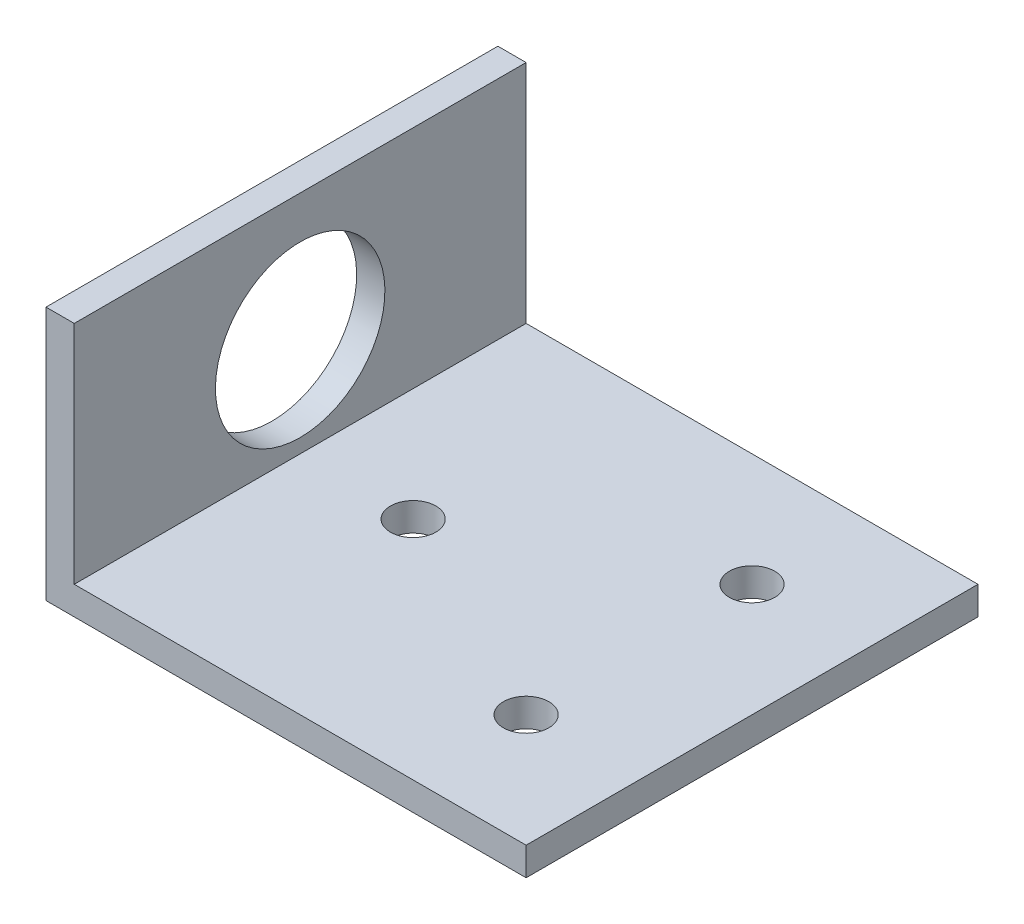
ISO-10303-21;
HEADER;
FILE_DESCRIPTION(('STEP AP214'),'2;1');
FILE_NAME('part.step','',(''),(''),'','','');
FILE_SCHEMA(('AUTOMOTIVE_DESIGN { 1 0 10303 214 1 1 1 1 }'));
ENDSEC;
DATA;
#1=APPLICATION_CONTEXT('core data for automotive mechanical design processes');
#2=APPLICATION_PROTOCOL_DEFINITION('international standard','automotive_design',2000,#1);
#3=PRODUCT_CONTEXT('',#1,'mechanical');
#4=PRODUCT('Part','Part','',(#3));
#5=PRODUCT_RELATED_PRODUCT_CATEGORY('part','',(#4));
#6=PRODUCT_DEFINITION_FORMATION('','',#4);
#7=PRODUCT_DEFINITION_CONTEXT('part definition',#1,'design');
#8=PRODUCT_DEFINITION('design','',#6,#7);
#9=PRODUCT_DEFINITION_SHAPE('','',#8);
#10=(LENGTH_UNIT() NAMED_UNIT(*) SI_UNIT(.MILLI.,.METRE.));
#11=(NAMED_UNIT(*) PLANE_ANGLE_UNIT() SI_UNIT($,.RADIAN.));
#12=(NAMED_UNIT(*) SI_UNIT($,.STERADIAN.) SOLID_ANGLE_UNIT());
#13=UNCERTAINTY_MEASURE_WITH_UNIT(LENGTH_MEASURE(1.E-05),#10,'distance_accuracy_value','');
#14=(GEOMETRIC_REPRESENTATION_CONTEXT(3) GLOBAL_UNCERTAINTY_ASSIGNED_CONTEXT((#13)) GLOBAL_UNIT_ASSIGNED_CONTEXT((#10,
#11,#12)) REPRESENTATION_CONTEXT('',''));
#15=CARTESIAN_POINT('',(0.,0.,0.));
#16=DIRECTION('',(0.,0.,1.));
#17=DIRECTION('',(1.,0.,0.));
#18=AXIS2_PLACEMENT_3D('',#15,#16,#17);
#19=CARTESIAN_POINT('',(3.175,50.8,50.8));
#20=DIRECTION('',(-1.,0.,0.));
#21=DIRECTION('',(0.,-1.,0.));
#22=AXIS2_PLACEMENT_3D('',#19,#20,#21);
#23=PLANE('',#22);
#24=CARTESIAN_POINT('',(3.175,14.2875,25.4));
#25=DIRECTION('',(-1.,0.,0.));
#26=DIRECTION('',(0.,-1.,0.));
#27=AXIS2_PLACEMENT_3D('',#24,#25,#26);
#28=CIRCLE('',#27,9.525);
#29=CARTESIAN_POINT('',(3.17500000000001,4.7625,25.4));
#30=VERTEX_POINT('',#29);
#31=EDGE_CURVE('E114',#30,#30,#28,.T.);
#32=ORIENTED_EDGE('',*,*,#31,.T.);
#33=EDGE_LOOP('',(#32));
#34=FACE_BOUND('',#33,.T.);
#35=DIRECTION('',(0.,1.,0.));
#36=VECTOR('',#35,1.);
#37=CARTESIAN_POINT('',(3.175,50.8,0.));
#38=LINE('',#37,#36);
#39=CARTESIAN_POINT('',(3.17500000000001,3.175,0.));
#40=VERTEX_POINT('',#39);
#41=CARTESIAN_POINT('',(3.175,28.575,0.));
#42=VERTEX_POINT('',#41);
#43=EDGE_CURVE('E110',#40,#42,#38,.T.);
#44=ORIENTED_EDGE('',*,*,#43,.T.);
#45=DIRECTION('',(0.,0.,1.));
#46=VECTOR('',#45,1.);
#47=CARTESIAN_POINT('',(3.175,28.575,50.8));
#48=LINE('',#47,#46);
#49=CARTESIAN_POINT('',(3.175,28.575,50.8));
#50=VERTEX_POINT('',#49);
#51=EDGE_CURVE('E48',#42,#50,#48,.T.);
#52=ORIENTED_EDGE('',*,*,#51,.T.);
#53=DIRECTION('',(0.,1.,0.));
#54=VECTOR('',#53,1.);
#55=CARTESIAN_POINT('',(3.175,50.8,50.8));
#56=LINE('',#55,#54);
#57=CARTESIAN_POINT('',(3.17500000000001,3.175,50.8));
#58=VERTEX_POINT('',#57);
#59=EDGE_CURVE('E120',#58,#50,#56,.T.);
#60=ORIENTED_EDGE('',*,*,#59,.F.);
#61=DIRECTION('',(0.,0.,-1.));
#62=VECTOR('',#61,1.);
#63=CARTESIAN_POINT('',(3.17500000000001,3.175,50.8));
#64=LINE('',#63,#62);
#65=EDGE_CURVE('E121',#58,#40,#64,.T.);
#66=ORIENTED_EDGE('',*,*,#65,.T.);
#67=EDGE_LOOP('',(#44,#52,#60,#66));
#68=FACE_BOUND('',#67,.T.);
#69=ADVANCED_FACE('F32',(#34,#68),#23,.F.);
#70=CARTESIAN_POINT('',(0.,50.8,50.8));
#71=DIRECTION('',(1.,0.,0.));
#72=DIRECTION('',(0.,1.,0.));
#73=AXIS2_PLACEMENT_3D('',#70,#71,#72);
#74=PLANE('',#73);
#75=CARTESIAN_POINT('',(0.,14.2875,25.4));
#76=DIRECTION('',(-1.,0.,0.));
#77=DIRECTION('',(0.,-1.,0.));
#78=AXIS2_PLACEMENT_3D('',#75,#76,#77);
#79=CIRCLE('',#78,9.525);
#80=CARTESIAN_POINT('',(0.,4.7625,25.4));
#81=VERTEX_POINT('',#80);
#82=EDGE_CURVE('E148',#81,#81,#79,.T.);
#83=ORIENTED_EDGE('',*,*,#82,.F.);
#84=EDGE_LOOP('',(#83));
#85=FACE_BOUND('',#84,.T.);
#86=DIRECTION('',(0.,-1.,0.));
#87=VECTOR('',#86,1.);
#88=CARTESIAN_POINT('',(0.,50.8,50.8));
#89=LINE('',#88,#87);
#90=CARTESIAN_POINT('',(0.,28.575,50.8));
#91=VERTEX_POINT('',#90);
#92=CARTESIAN_POINT('',(0.,0.,50.8));
#93=VERTEX_POINT('',#92);
#94=EDGE_CURVE('E84',#91,#93,#89,.T.);
#95=ORIENTED_EDGE('',*,*,#94,.F.);
#96=DIRECTION('',(0.,0.,1.));
#97=VECTOR('',#96,1.);
#98=CARTESIAN_POINT('',(0.,28.575,50.8));
#99=LINE('',#98,#97);
#100=CARTESIAN_POINT('',(0.,28.575,0.));
#101=VERTEX_POINT('',#100);
#102=EDGE_CURVE('E94',#101,#91,#99,.T.);
#103=ORIENTED_EDGE('',*,*,#102,.F.);
#104=DIRECTION('',(0.,-1.,0.));
#105=VECTOR('',#104,1.);
#106=CARTESIAN_POINT('',(0.,50.8,0.));
#107=LINE('',#106,#105);
#108=CARTESIAN_POINT('',(0.,0.,0.));
#109=VERTEX_POINT('',#108);
#110=EDGE_CURVE('E101',#101,#109,#107,.T.);
#111=ORIENTED_EDGE('',*,*,#110,.T.);
#112=DIRECTION('',(0.,0.,-1.));
#113=VECTOR('',#112,1.);
#114=CARTESIAN_POINT('',(0.,0.,50.8));
#115=LINE('',#114,#113);
#116=EDGE_CURVE('E40',#93,#109,#115,.T.);
#117=ORIENTED_EDGE('',*,*,#116,.F.);
#118=EDGE_LOOP('',(#95,#103,#111,#117));
#119=FACE_BOUND('',#118,.T.);
#120=ADVANCED_FACE('F100',(#85,#119),#74,.F.);
#121=CARTESIAN_POINT('',(3.17500000000001,0.,50.8));
#122=DIRECTION('',(0.,1.,0.));
#123=DIRECTION('',(-1.,0.,0.));
#124=AXIS2_PLACEMENT_3D('',#121,#122,#123);
#125=PLANE('',#124);
#126=CARTESIAN_POINT('',(41.275,0.,12.7));
#127=DIRECTION('',(0.,-1.,0.));
#128=DIRECTION('',(1.,0.,0.));
#129=AXIS2_PLACEMENT_3D('',#126,#127,#128);
#130=CIRCLE('',#129,2.5527);
#131=CARTESIAN_POINT('',(43.8277,0.,12.7));
#132=VERTEX_POINT('',#131);
#133=EDGE_CURVE('E143',#132,#132,#130,.T.);
#134=ORIENTED_EDGE('',*,*,#133,.F.);
#135=EDGE_LOOP('',(#134));
#136=FACE_BOUND('',#135,.T.);
#137=CARTESIAN_POINT('',(41.275,0.,38.1));
#138=DIRECTION('',(0.,-1.,0.));
#139=DIRECTION('',(1.,0.,0.));
#140=AXIS2_PLACEMENT_3D('',#137,#138,#139);
#141=CIRCLE('',#140,2.5527);
#142=CARTESIAN_POINT('',(43.8277,0.,38.1));
#143=VERTEX_POINT('',#142);
#144=EDGE_CURVE('E133',#143,#143,#141,.T.);
#145=ORIENTED_EDGE('',*,*,#144,.F.);
#146=EDGE_LOOP('',(#145));
#147=FACE_BOUND('',#146,.T.);
#148=CARTESIAN_POINT('',(15.875,0.,25.4));
#149=DIRECTION('',(0.,-1.,0.));
#150=DIRECTION('',(1.,0.,0.));
#151=AXIS2_PLACEMENT_3D('',#148,#149,#150);
#152=CIRCLE('',#151,2.5527);
#153=CARTESIAN_POINT('',(18.4277,0.,25.4));
#154=VERTEX_POINT('',#153);
#155=EDGE_CURVE('E130',#154,#154,#152,.T.);
#156=ORIENTED_EDGE('',*,*,#155,.F.);
#157=EDGE_LOOP('',(#156));
#158=FACE_BOUND('',#157,.T.);
#159=DIRECTION('',(1.,0.,0.));
#160=VECTOR('',#159,1.);
#161=CARTESIAN_POINT('',(3.17500000000001,0.,0.));
#162=LINE('',#161,#160);
#163=CARTESIAN_POINT('',(53.975,0.,0.));
#164=VERTEX_POINT('',#163);
#165=EDGE_CURVE('E108',#109,#164,#162,.T.);
#166=ORIENTED_EDGE('',*,*,#165,.T.);
#167=DIRECTION('',(0.,0.,-1.));
#168=VECTOR('',#167,1.);
#169=CARTESIAN_POINT('',(53.975,0.,50.8));
#170=LINE('',#169,#168);
#171=CARTESIAN_POINT('',(53.975,0.,50.8));
#172=VERTEX_POINT('',#171);
#173=EDGE_CURVE('E125',#172,#164,#170,.T.);
#174=ORIENTED_EDGE('',*,*,#173,.F.);
#175=DIRECTION('',(1.,0.,0.));
#176=VECTOR('',#175,1.);
#177=CARTESIAN_POINT('',(3.17500000000001,0.,50.8));
#178=LINE('',#177,#176);
#179=EDGE_CURVE('E155',#93,#172,#178,.T.);
#180=ORIENTED_EDGE('',*,*,#179,.F.);
#181=ORIENTED_EDGE('',*,*,#116,.T.);
#182=EDGE_LOOP('',(#166,#174,#180,#181));
#183=FACE_BOUND('',#182,.T.);
#184=ADVANCED_FACE('F173',(#136,#147,#158,#183),#125,.F.);
#185=CARTESIAN_POINT('',(53.975,0.,50.8));
#186=DIRECTION('',(-1.,0.,0.));
#187=DIRECTION('',(0.,0.,1.));
#188=AXIS2_PLACEMENT_3D('',#185,#186,#187);
#189=PLANE('',#188);
#190=DIRECTION('',(0.,1.,0.));
#191=VECTOR('',#190,1.);
#192=CARTESIAN_POINT('',(53.975,0.,0.));
#193=LINE('',#192,#191);
#194=CARTESIAN_POINT('',(53.975,3.175,0.));
#195=VERTEX_POINT('',#194);
#196=EDGE_CURVE('E112',#164,#195,#193,.T.);
#197=ORIENTED_EDGE('',*,*,#196,.T.);
#198=DIRECTION('',(0.,0.,-1.));
#199=VECTOR('',#198,1.);
#200=CARTESIAN_POINT('',(53.975,3.175,50.8));
#201=LINE('',#200,#199);
#202=CARTESIAN_POINT('',(53.975,3.175,50.8));
#203=VERTEX_POINT('',#202);
#204=EDGE_CURVE('E123',#203,#195,#201,.T.);
#205=ORIENTED_EDGE('',*,*,#204,.F.);
#206=DIRECTION('',(0.,1.,0.));
#207=VECTOR('',#206,1.);
#208=CARTESIAN_POINT('',(53.975,0.,50.8));
#209=LINE('',#208,#207);
#210=EDGE_CURVE('E157',#172,#203,#209,.T.);
#211=ORIENTED_EDGE('',*,*,#210,.F.);
#212=ORIENTED_EDGE('',*,*,#173,.T.);
#213=EDGE_LOOP('',(#197,#205,#211,#212));
#214=FACE_BOUND('',#213,.T.);
#215=ADVANCED_FACE('F164',(#214),#189,.F.);
#216=CARTESIAN_POINT('',(3.17500000000001,3.175,50.8));
#217=DIRECTION('',(0.,-1.,0.));
#218=DIRECTION('',(0.,0.,-1.));
#219=AXIS2_PLACEMENT_3D('',#216,#217,#218);
#220=PLANE('',#219);
#221=CARTESIAN_POINT('',(41.275,3.175,12.7));
#222=DIRECTION('',(0.,-1.,0.));
#223=DIRECTION('',(0.,0.,-1.));
#224=AXIS2_PLACEMENT_3D('',#221,#222,#223);
#225=CIRCLE('',#224,2.5527);
#226=CARTESIAN_POINT('',(41.275,3.175,10.1473));
#227=VERTEX_POINT('',#226);
#228=EDGE_CURVE('E35',#227,#227,#225,.T.);
#229=ORIENTED_EDGE('',*,*,#228,.T.);
#230=EDGE_LOOP('',(#229));
#231=FACE_BOUND('',#230,.T.);
#232=CARTESIAN_POINT('',(41.275,3.175,38.1));
#233=DIRECTION('',(0.,-1.,0.));
#234=DIRECTION('',(0.,0.,-1.));
#235=AXIS2_PLACEMENT_3D('',#232,#233,#234);
#236=CIRCLE('',#235,2.5527);
#237=CARTESIAN_POINT('',(41.275,3.175,35.5473));
#238=VERTEX_POINT('',#237);
#239=EDGE_CURVE('E131',#238,#238,#236,.T.);
#240=ORIENTED_EDGE('',*,*,#239,.T.);
#241=EDGE_LOOP('',(#240));
#242=FACE_BOUND('',#241,.T.);
#243=CARTESIAN_POINT('',(15.875,3.175,25.4));
#244=DIRECTION('',(0.,-1.,0.));
#245=DIRECTION('',(0.,0.,-1.));
#246=AXIS2_PLACEMENT_3D('',#243,#244,#245);
#247=CIRCLE('',#246,2.5527);
#248=CARTESIAN_POINT('',(15.875,3.175,22.8473));
#249=VERTEX_POINT('',#248);
#250=EDGE_CURVE('E104',#249,#249,#247,.T.);
#251=ORIENTED_EDGE('',*,*,#250,.T.);
#252=EDGE_LOOP('',(#251));
#253=FACE_BOUND('',#252,.T.);
#254=DIRECTION('',(-1.,0.,0.));
#255=VECTOR('',#254,1.);
#256=CARTESIAN_POINT('',(3.17500000000001,3.175,0.));
#257=LINE('',#256,#255);
#258=EDGE_CURVE('E77',#195,#40,#257,.T.);
#259=ORIENTED_EDGE('',*,*,#258,.T.);
#260=ORIENTED_EDGE('',*,*,#65,.F.);
#261=DIRECTION('',(-1.,0.,0.));
#262=VECTOR('',#261,1.);
#263=CARTESIAN_POINT('',(3.17500000000001,3.175,50.8));
#264=LINE('',#263,#262);
#265=EDGE_CURVE('E56',#203,#58,#264,.T.);
#266=ORIENTED_EDGE('',*,*,#265,.F.);
#267=ORIENTED_EDGE('',*,*,#204,.T.);
#268=EDGE_LOOP('',(#259,#260,#266,#267));
#269=FACE_BOUND('',#268,.T.);
#270=ADVANCED_FACE('F165',(#231,#242,#253,#269),#220,.F.);
#271=CARTESIAN_POINT('',(0.,0.,50.8));
#272=DIRECTION('',(0.,0.,1.));
#273=DIRECTION('',(1.,0.,0.));
#274=AXIS2_PLACEMENT_3D('',#271,#272,#273);
#275=PLANE('',#274);
#276=DIRECTION('',(-1.,0.,0.));
#277=VECTOR('',#276,1.);
#278=CARTESIAN_POINT('',(50.8,28.575,50.8));
#279=LINE('',#278,#277);
#280=EDGE_CURVE('E103',#50,#91,#279,.T.);
#281=ORIENTED_EDGE('',*,*,#280,.T.);
#282=ORIENTED_EDGE('',*,*,#94,.T.);
#283=ORIENTED_EDGE('',*,*,#179,.T.);
#284=ORIENTED_EDGE('',*,*,#210,.T.);
#285=ORIENTED_EDGE('',*,*,#265,.T.);
#286=ORIENTED_EDGE('',*,*,#59,.T.);
#287=EDGE_LOOP('',(#281,#282,#283,#284,#285,#286));
#288=FACE_BOUND('',#287,.T.);
#289=ADVANCED_FACE('F160',(#288),#275,.T.);
#290=CARTESIAN_POINT('',(0.,0.,0.));
#291=DIRECTION('',(0.,0.,1.));
#292=DIRECTION('',(1.,0.,0.));
#293=AXIS2_PLACEMENT_3D('',#290,#291,#292);
#294=PLANE('',#293);
#295=ORIENTED_EDGE('',*,*,#110,.F.);
#296=DIRECTION('',(1.,0.,0.));
#297=VECTOR('',#296,1.);
#298=CARTESIAN_POINT('',(0.,28.575,0.));
#299=LINE('',#298,#297);
#300=EDGE_CURVE('E11',#101,#42,#299,.T.);
#301=ORIENTED_EDGE('',*,*,#300,.T.);
#302=ORIENTED_EDGE('',*,*,#43,.F.);
#303=ORIENTED_EDGE('',*,*,#258,.F.);
#304=ORIENTED_EDGE('',*,*,#196,.F.);
#305=ORIENTED_EDGE('',*,*,#165,.F.);
#306=EDGE_LOOP('',(#295,#301,#302,#303,#304,#305));
#307=FACE_BOUND('',#306,.T.);
#308=ADVANCED_FACE('F106',(#307),#294,.F.);
#309=CARTESIAN_POINT('',(50.8,14.2875,25.4));
#310=DIRECTION('',(-1.,0.,0.));
#311=DIRECTION('',(0.,-1.,0.));
#312=AXIS2_PLACEMENT_3D('',#309,#310,#311);
#313=CYLINDRICAL_SURFACE('',#312,9.525);
#314=ORIENTED_EDGE('',*,*,#82,.T.);
#315=EDGE_LOOP('',(#314));
#316=FACE_BOUND('',#315,.T.);
#317=ORIENTED_EDGE('',*,*,#31,.F.);
#318=EDGE_LOOP('',(#317));
#319=FACE_BOUND('',#318,.T.);
#320=ADVANCED_FACE('F177',(#316,#319),#313,.F.);
#321=CARTESIAN_POINT('',(50.8,28.575,50.8));
#322=DIRECTION('',(0.,-1.,0.));
#323=DIRECTION('',(0.,0.,-1.));
#324=AXIS2_PLACEMENT_3D('',#321,#322,#323);
#325=PLANE('',#324);
#326=ORIENTED_EDGE('',*,*,#300,.F.);
#327=ORIENTED_EDGE('',*,*,#102,.T.);
#328=ORIENTED_EDGE('',*,*,#280,.F.);
#329=ORIENTED_EDGE('',*,*,#51,.F.);
#330=EDGE_LOOP('',(#326,#327,#328,#329));
#331=FACE_BOUND('',#330,.T.);
#332=ADVANCED_FACE('F93',(#331),#325,.F.);
#333=CARTESIAN_POINT('',(15.875,50.8,25.4));
#334=DIRECTION('',(0.,-1.,0.));
#335=DIRECTION('',(1.,0.,0.));
#336=AXIS2_PLACEMENT_3D('',#333,#334,#335);
#337=CYLINDRICAL_SURFACE('',#336,2.5527);
#338=ORIENTED_EDGE('',*,*,#155,.T.);
#339=EDGE_LOOP('',(#338));
#340=FACE_BOUND('',#339,.T.);
#341=ORIENTED_EDGE('',*,*,#250,.F.);
#342=EDGE_LOOP('',(#341));
#343=FACE_BOUND('',#342,.T.);
#344=ADVANCED_FACE('F185',(#340,#343),#337,.F.);
#345=CARTESIAN_POINT('',(41.275,50.8,38.1));
#346=DIRECTION('',(0.,-1.,0.));
#347=DIRECTION('',(1.,0.,0.));
#348=AXIS2_PLACEMENT_3D('',#345,#346,#347);
#349=CYLINDRICAL_SURFACE('',#348,2.5527);
#350=ORIENTED_EDGE('',*,*,#144,.T.);
#351=EDGE_LOOP('',(#350));
#352=FACE_BOUND('',#351,.T.);
#353=ORIENTED_EDGE('',*,*,#239,.F.);
#354=EDGE_LOOP('',(#353));
#355=FACE_BOUND('',#354,.T.);
#356=ADVANCED_FACE('F210',(#352,#355),#349,.F.);
#357=CARTESIAN_POINT('',(41.275,50.8,12.7));
#358=DIRECTION('',(0.,-1.,0.));
#359=DIRECTION('',(1.,0.,0.));
#360=AXIS2_PLACEMENT_3D('',#357,#358,#359);
#361=CYLINDRICAL_SURFACE('',#360,2.5527);
#362=ORIENTED_EDGE('',*,*,#133,.T.);
#363=EDGE_LOOP('',(#362));
#364=FACE_BOUND('',#363,.T.);
#365=ORIENTED_EDGE('',*,*,#228,.F.);
#366=EDGE_LOOP('',(#365));
#367=FACE_BOUND('',#366,.T.);
#368=ADVANCED_FACE('F216',(#364,#367),#361,.F.);
#369=CLOSED_SHELL('',(#69,#120,#184,#215,#270,#289,#308,#320,#332,#344,#356,#368));
#370=MANIFOLD_SOLID_BREP('B2',#369);
#371=ADVANCED_BREP_SHAPE_REPRESENTATION('',(#18,#370),#14);
#372=SHAPE_DEFINITION_REPRESENTATION(#9,#371);
ENDSEC;
END-ISO-10303-21;
